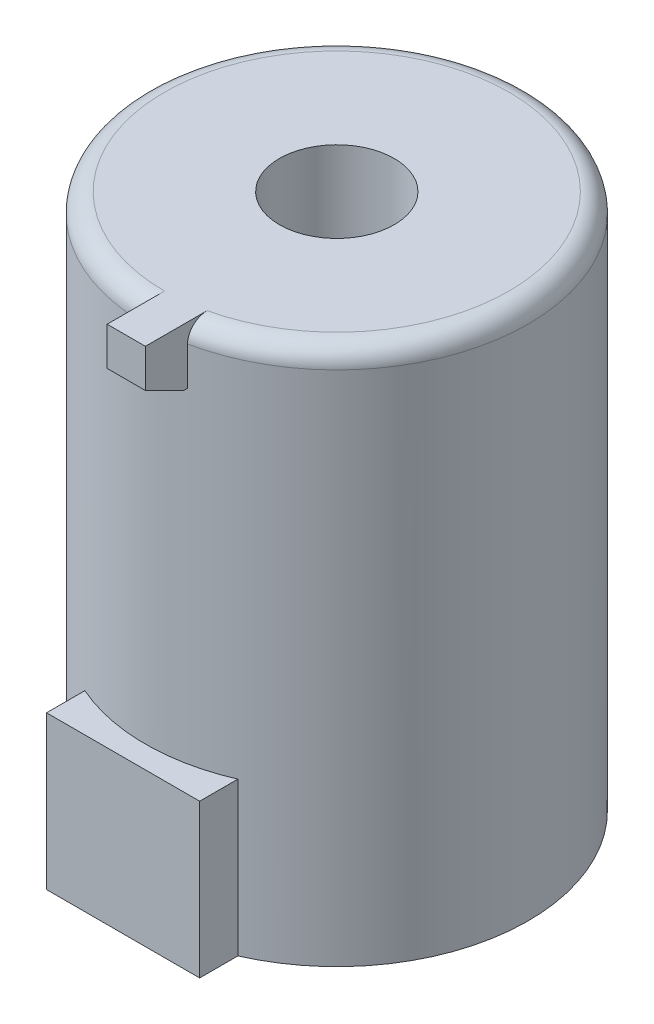
ISO-10303-21;
HEADER;
FILE_DESCRIPTION(('STEP AP214'),'2;1');
FILE_NAME('part.step','',(''),(''),'','','');
FILE_SCHEMA(('AUTOMOTIVE_DESIGN { 1 0 10303 214 1 1 1 1 }'));
ENDSEC;
DATA;
#1=APPLICATION_CONTEXT('core data for automotive mechanical design processes');
#2=APPLICATION_PROTOCOL_DEFINITION('international standard','automotive_design',2000,#1);
#3=PRODUCT_CONTEXT('',#1,'mechanical');
#4=PRODUCT('Part','Part','',(#3));
#5=PRODUCT_RELATED_PRODUCT_CATEGORY('part','',(#4));
#6=PRODUCT_DEFINITION_FORMATION('','',#4);
#7=PRODUCT_DEFINITION_CONTEXT('part definition',#1,'design');
#8=PRODUCT_DEFINITION('design','',#6,#7);
#9=PRODUCT_DEFINITION_SHAPE('','',#8);
#10=(LENGTH_UNIT() NAMED_UNIT(*) SI_UNIT(.MILLI.,.METRE.));
#11=(NAMED_UNIT(*) PLANE_ANGLE_UNIT() SI_UNIT($,.RADIAN.));
#12=(NAMED_UNIT(*) SI_UNIT($,.STERADIAN.) SOLID_ANGLE_UNIT());
#13=UNCERTAINTY_MEASURE_WITH_UNIT(LENGTH_MEASURE(1.E-05),#10,'distance_accuracy_value','');
#14=(GEOMETRIC_REPRESENTATION_CONTEXT(3) GLOBAL_UNCERTAINTY_ASSIGNED_CONTEXT((#13)) GLOBAL_UNIT_ASSIGNED_CONTEXT((#10,
#11,#12)) REPRESENTATION_CONTEXT('',''));
#15=CARTESIAN_POINT('',(0.,0.,0.));
#16=DIRECTION('',(0.,0.,1.));
#17=DIRECTION('',(1.,0.,0.));
#18=AXIS2_PLACEMENT_3D('',#15,#16,#17);
#19=CARTESIAN_POINT('',(0.,140.,0.));
#20=DIRECTION('',(0.,-1.,0.));
#21=DIRECTION('',(0.,0.,-1.));
#22=AXIS2_PLACEMENT_3D('',#19,#20,#21);
#23=CYLINDRICAL_SURFACE('',#22,50.);
#24=CARTESIAN_POINT('',(0.,40.,0.));
#25=DIRECTION('',(0.,1.,0.));
#26=DIRECTION('',(0.,0.,1.));
#27=AXIS2_PLACEMENT_3D('',#24,#25,#26);
#28=CIRCLE('',#27,50.);
#29=CARTESIAN_POINT('',(-20.,40.,45.8257569495584));
#30=VERTEX_POINT('',#29);
#31=CARTESIAN_POINT('',(20.,40.,45.8257569495584));
#32=VERTEX_POINT('',#31);
#33=EDGE_CURVE('E191',#30,#32,#28,.T.);
#34=ORIENTED_EDGE('',*,*,#33,.T.);
#35=DIRECTION('',(0.,-1.,0.));
#36=VECTOR('',#35,1.);
#37=CARTESIAN_POINT('',(20.,40.,45.8257569495584));
#38=LINE('',#37,#36);
#39=CARTESIAN_POINT('',(20.,0.,45.8257569495584));
#40=VERTEX_POINT('',#39);
#41=EDGE_CURVE('E185',#32,#40,#38,.T.);
#42=ORIENTED_EDGE('',*,*,#41,.T.);
#43=CARTESIAN_POINT('',(0.,0.,0.));
#44=DIRECTION('',(0.,1.,0.));
#45=DIRECTION('',(0.,0.,1.));
#46=AXIS2_PLACEMENT_3D('',#43,#44,#45);
#47=CIRCLE('',#46,50.);
#48=CARTESIAN_POINT('',(-20.,0.,45.8257569495584));
#49=VERTEX_POINT('',#48);
#50=EDGE_CURVE('E182',#40,#49,#47,.T.);
#51=ORIENTED_EDGE('',*,*,#50,.T.);
#52=DIRECTION('',(0.,-1.,0.));
#53=VECTOR('',#52,1.);
#54=CARTESIAN_POINT('',(-20.,40.,45.8257569495584));
#55=LINE('',#54,#53);
#56=EDGE_CURVE('E172',#30,#49,#55,.T.);
#57=ORIENTED_EDGE('',*,*,#56,.F.);
#58=EDGE_LOOP('',(#34,#42,#51,#57));
#59=FACE_BOUND('',#58,.T.);
#60=DIRECTION('',(0.,-1.,0.));
#61=VECTOR('',#60,1.);
#62=CARTESIAN_POINT('',(0.,140.,50.));
#63=LINE('',#62,#61);
#64=CARTESIAN_POINT('',(0.,125.,50.));
#65=VERTEX_POINT('',#64);
#66=CARTESIAN_POINT('',(0.,135.,50.));
#67=VERTEX_POINT('',#66);
#68=EDGE_CURVE('E131',#65,#67,#63,.F.);
#69=ORIENTED_EDGE('',*,*,#68,.T.);
#70=CARTESIAN_POINT('',(0.,135.,0.));
#71=DIRECTION('',(0.,1.,0.));
#72=DIRECTION('',(0.,0.,1.));
#73=AXIS2_PLACEMENT_3D('',#70,#71,#72);
#74=CIRCLE('',#73,50.);
#75=CARTESIAN_POINT('',(10.,135.,48.9897948556636));
#76=VERTEX_POINT('',#75);
#77=EDGE_CURVE('E60',#67,#76,#74,.F.);
#78=ORIENTED_EDGE('',*,*,#77,.T.);
#79=DIRECTION('',(0.,-1.,0.));
#80=VECTOR('',#79,1.);
#81=CARTESIAN_POINT('',(10.,140.,48.9897948556636));
#82=LINE('',#81,#80);
#83=CARTESIAN_POINT('',(10.,125.,48.9897948556636));
#84=VERTEX_POINT('',#83);
#85=EDGE_CURVE('E153',#84,#76,#82,.F.);
#86=ORIENTED_EDGE('',*,*,#85,.F.);
#87=CARTESIAN_POINT('',(0.,125.,0.));
#88=DIRECTION('',(0.,1.,0.));
#89=DIRECTION('',(0.,0.,1.));
#90=AXIS2_PLACEMENT_3D('',#87,#88,#89);
#91=CIRCLE('',#90,50.);
#92=EDGE_CURVE('E193',#65,#84,#91,.T.);
#93=ORIENTED_EDGE('',*,*,#92,.F.);
#94=EDGE_LOOP('',(#69,#78,#86,#93));
#95=FACE_BOUND('',#94,.T.);
#96=ADVANCED_FACE('F34',(#59,#95),#23,.T.);
#97=CARTESIAN_POINT('',(0.,140.,0.));
#98=DIRECTION('',(0.,1.,0.));
#99=DIRECTION('',(0.,0.,1.));
#100=AXIS2_PLACEMENT_3D('',#97,#98,#99);
#101=PLANE('',#100);
#102=CARTESIAN_POINT('',(0.,140.,0.));
#103=DIRECTION('',(0.,1.,0.));
#104=DIRECTION('',(0.,0.,1.));
#105=AXIS2_PLACEMENT_3D('',#102,#103,#104);
#106=CIRCLE('',#105,45.);
#107=CARTESIAN_POINT('',(10.,140.,43.8748219369606));
#108=VERTEX_POINT('',#107);
#109=CARTESIAN_POINT('',(0.,140.,45.));
#110=VERTEX_POINT('',#109);
#111=EDGE_CURVE('E195',#108,#110,#106,.T.);
#112=ORIENTED_EDGE('',*,*,#111,.T.);
#113=DIRECTION('',(0.,0.,1.));
#114=VECTOR('',#113,1.);
#115=CARTESIAN_POINT('',(0.,140.,50.));
#116=LINE('',#115,#114);
#117=CARTESIAN_POINT('',(0.,140.,60.));
#118=VERTEX_POINT('',#117);
#119=EDGE_CURVE('E128',#110,#118,#116,.T.);
#120=ORIENTED_EDGE('',*,*,#119,.T.);
#121=DIRECTION('',(-1.,0.,0.));
#122=VECTOR('',#121,1.);
#123=CARTESIAN_POINT('',(10.,140.,60.));
#124=LINE('',#123,#122);
#125=CARTESIAN_POINT('',(10.,140.,60.));
#126=VERTEX_POINT('',#125);
#127=EDGE_CURVE('E125',#126,#118,#124,.T.);
#128=ORIENTED_EDGE('',*,*,#127,.F.);
#129=DIRECTION('',(0.,0.,1.));
#130=VECTOR('',#129,1.);
#131=CARTESIAN_POINT('',(10.,140.,50.));
#132=LINE('',#131,#130);
#133=EDGE_CURVE('E111',#108,#126,#132,.T.);
#134=ORIENTED_EDGE('',*,*,#133,.F.);
#135=EDGE_LOOP('',(#112,#120,#128,#134));
#136=FACE_BOUND('',#135,.T.);
#137=CARTESIAN_POINT('',(0.,140.,0.));
#138=DIRECTION('',(0.,1.,0.));
#139=DIRECTION('',(0.,0.,1.));
#140=AXIS2_PLACEMENT_3D('',#137,#138,#139);
#141=CIRCLE('',#140,15.);
#142=CARTESIAN_POINT('',(0.,140.,15.));
#143=VERTEX_POINT('',#142);
#144=EDGE_CURVE('E155',#143,#143,#141,.T.);
#145=ORIENTED_EDGE('',*,*,#144,.F.);
#146=EDGE_LOOP('',(#145));
#147=FACE_BOUND('',#146,.T.);
#148=ADVANCED_FACE('F126',(#136,#147),#101,.T.);
#149=CARTESIAN_POINT('',(0.,0.,0.));
#150=DIRECTION('',(0.,1.,0.));
#151=DIRECTION('',(0.,0.,1.));
#152=AXIS2_PLACEMENT_3D('',#149,#150,#151);
#153=PLANE('',#152);
#154=ORIENTED_EDGE('',*,*,#50,.F.);
#155=DIRECTION('',(0.,0.,1.));
#156=VECTOR('',#155,1.);
#157=CARTESIAN_POINT('',(20.,0.,45.8257569495584));
#158=LINE('',#157,#156);
#159=CARTESIAN_POINT('',(20.,0.,55.8257569495584));
#160=VERTEX_POINT('',#159);
#161=EDGE_CURVE('E175',#40,#160,#158,.T.);
#162=ORIENTED_EDGE('',*,*,#161,.T.);
#163=DIRECTION('',(-1.,0.,0.));
#164=VECTOR('',#163,1.);
#165=CARTESIAN_POINT('',(-20.,0.,55.8257569495584));
#166=LINE('',#165,#164);
#167=CARTESIAN_POINT('',(-20.,0.,55.8257569495584));
#168=VERTEX_POINT('',#167);
#169=EDGE_CURVE('E166',#160,#168,#166,.T.);
#170=ORIENTED_EDGE('',*,*,#169,.T.);
#171=DIRECTION('',(0.,0.,-1.));
#172=VECTOR('',#171,1.);
#173=CARTESIAN_POINT('',(-20.,0.,45.8257569495584));
#174=LINE('',#173,#172);
#175=EDGE_CURVE('E159',#168,#49,#174,.T.);
#176=ORIENTED_EDGE('',*,*,#175,.T.);
#177=EDGE_LOOP('',(#154,#162,#170,#176));
#178=FACE_BOUND('',#177,.T.);
#179=ADVANCED_FACE('F211',(#178),#153,.F.);
#180=CARTESIAN_POINT('',(-20.,40.,45.8257569495584));
#181=DIRECTION('',(-1.,0.,0.));
#182=DIRECTION('',(0.,0.,1.));
#183=AXIS2_PLACEMENT_3D('',#180,#181,#182);
#184=PLANE('',#183);
#185=ORIENTED_EDGE('',*,*,#175,.F.);
#186=DIRECTION('',(0.,-1.,0.));
#187=VECTOR('',#186,1.);
#188=CARTESIAN_POINT('',(-20.,40.,55.8257569495584));
#189=LINE('',#188,#187);
#190=CARTESIAN_POINT('',(-20.,40.,55.8257569495584));
#191=VERTEX_POINT('',#190);
#192=EDGE_CURVE('E180',#191,#168,#189,.T.);
#193=ORIENTED_EDGE('',*,*,#192,.F.);
#194=DIRECTION('',(0.,0.,-1.));
#195=VECTOR('',#194,1.);
#196=CARTESIAN_POINT('',(-20.,40.,45.8257569495584));
#197=LINE('',#196,#195);
#198=EDGE_CURVE('E162',#191,#30,#197,.T.);
#199=ORIENTED_EDGE('',*,*,#198,.T.);
#200=ORIENTED_EDGE('',*,*,#56,.T.);
#201=EDGE_LOOP('',(#185,#193,#199,#200));
#202=FACE_BOUND('',#201,.T.);
#203=ADVANCED_FACE('F215',(#202),#184,.T.);
#204=CARTESIAN_POINT('',(-20.,40.,55.8257569495584));
#205=DIRECTION('',(0.,0.,1.));
#206=DIRECTION('',(1.,0.,0.));
#207=AXIS2_PLACEMENT_3D('',#204,#205,#206);
#208=PLANE('',#207);
#209=ORIENTED_EDGE('',*,*,#169,.F.);
#210=DIRECTION('',(0.,-1.,0.));
#211=VECTOR('',#210,1.);
#212=CARTESIAN_POINT('',(20.,40.,55.8257569495584));
#213=LINE('',#212,#211);
#214=CARTESIAN_POINT('',(20.,40.,55.8257569495584));
#215=VERTEX_POINT('',#214);
#216=EDGE_CURVE('E183',#215,#160,#213,.T.);
#217=ORIENTED_EDGE('',*,*,#216,.F.);
#218=DIRECTION('',(-1.,0.,0.));
#219=VECTOR('',#218,1.);
#220=CARTESIAN_POINT('',(-20.,40.,55.8257569495584));
#221=LINE('',#220,#219);
#222=EDGE_CURVE('E169',#215,#191,#221,.T.);
#223=ORIENTED_EDGE('',*,*,#222,.T.);
#224=ORIENTED_EDGE('',*,*,#192,.T.);
#225=EDGE_LOOP('',(#209,#217,#223,#224));
#226=FACE_BOUND('',#225,.T.);
#227=ADVANCED_FACE('F220',(#226),#208,.T.);
#228=CARTESIAN_POINT('',(20.,40.,45.8257569495584));
#229=DIRECTION('',(1.,0.,0.));
#230=DIRECTION('',(0.,0.,-1.));
#231=AXIS2_PLACEMENT_3D('',#228,#229,#230);
#232=PLANE('',#231);
#233=ORIENTED_EDGE('',*,*,#161,.F.);
#234=ORIENTED_EDGE('',*,*,#41,.F.);
#235=DIRECTION('',(0.,0.,1.));
#236=VECTOR('',#235,1.);
#237=CARTESIAN_POINT('',(20.,40.,45.8257569495584));
#238=LINE('',#237,#236);
#239=EDGE_CURVE('E165',#32,#215,#238,.T.);
#240=ORIENTED_EDGE('',*,*,#239,.T.);
#241=ORIENTED_EDGE('',*,*,#216,.T.);
#242=EDGE_LOOP('',(#233,#234,#240,#241));
#243=FACE_BOUND('',#242,.T.);
#244=ADVANCED_FACE('F222',(#243),#232,.T.);
#245=CARTESIAN_POINT('',(0.,40.,0.));
#246=DIRECTION('',(0.,1.,0.));
#247=DIRECTION('',(0.,0.,1.));
#248=AXIS2_PLACEMENT_3D('',#245,#246,#247);
#249=PLANE('',#248);
#250=ORIENTED_EDGE('',*,*,#33,.F.);
#251=ORIENTED_EDGE('',*,*,#198,.F.);
#252=ORIENTED_EDGE('',*,*,#222,.F.);
#253=ORIENTED_EDGE('',*,*,#239,.F.);
#254=EDGE_LOOP('',(#250,#251,#252,#253));
#255=FACE_BOUND('',#254,.T.);
#256=ADVANCED_FACE('F225',(#255),#249,.T.);
#257=CARTESIAN_POINT('',(0.,100.,0.));
#258=DIRECTION('',(0.,1.,0.));
#259=DIRECTION('',(0.,0.,1.));
#260=AXIS2_PLACEMENT_3D('',#257,#258,#259);
#261=CYLINDRICAL_SURFACE('',#260,15.);
#262=CARTESIAN_POINT('',(0.,100.,0.));
#263=DIRECTION('',(0.,1.,0.));
#264=DIRECTION('',(0.,0.,1.));
#265=AXIS2_PLACEMENT_3D('',#262,#263,#264);
#266=CIRCLE('',#265,15.);
#267=CARTESIAN_POINT('',(0.,100.,15.));
#268=VERTEX_POINT('',#267);
#269=EDGE_CURVE('E156',#268,#268,#266,.T.);
#270=ORIENTED_EDGE('',*,*,#269,.F.);
#271=EDGE_LOOP('',(#270));
#272=FACE_BOUND('',#271,.T.);
#273=ORIENTED_EDGE('',*,*,#144,.T.);
#274=EDGE_LOOP('',(#273));
#275=FACE_BOUND('',#274,.T.);
#276=ADVANCED_FACE('F232',(#272,#275),#261,.F.);
#277=CARTESIAN_POINT('',(0.,100.,0.));
#278=DIRECTION('',(0.,1.,0.));
#279=DIRECTION('',(0.,0.,1.));
#280=AXIS2_PLACEMENT_3D('',#277,#278,#279);
#281=PLANE('',#280);
#282=ORIENTED_EDGE('',*,*,#269,.T.);
#283=EDGE_LOOP('',(#282));
#284=FACE_BOUND('',#283,.T.);
#285=ADVANCED_FACE('F236',(#284),#281,.T.);
#286=CARTESIAN_POINT('',(10.,0.,0.));
#287=DIRECTION('',(-1.,0.,0.));
#288=DIRECTION('',(0.,0.,1.));
#289=AXIS2_PLACEMENT_3D('',#286,#287,#288);
#290=PLANE('',#289);
#291=DIRECTION('',(0.,0.,-1.));
#292=VECTOR('',#291,1.);
#293=CARTESIAN_POINT('',(10.,125.,44.5875534039273));
#294=LINE('',#293,#292);
#295=CARTESIAN_POINT('',(10.,125.,50.));
#296=VERTEX_POINT('',#295);
#297=EDGE_CURVE('E139',#296,#84,#294,.T.);
#298=ORIENTED_EDGE('',*,*,#297,.T.);
#299=ORIENTED_EDGE('',*,*,#85,.T.);
#300=CARTESIAN_POINT('',(10.,135.,48.9897948556636));
#301=CARTESIAN_POINT('',(10.,135.138506627266,48.9898115538362));
#302=CARTESIAN_POINT('',(10.,135.277010148974,48.9839216720948));
#303=CARTESIAN_POINT('',(10.,135.553011598371,48.960449901164));
#304=CARTESIAN_POINT('',(10.,135.690509610314,48.942869003211));
#305=CARTESIAN_POINT('',(10.,135.963349241789,48.896166309564));
#306=CARTESIAN_POINT('',(10.,136.098693402898,48.8670593578651));
#307=CARTESIAN_POINT('',(10.,136.366444491823,48.7975391729353));
#308=CARTESIAN_POINT('',(10.,136.498851435119,48.7571259993039));
#309=CARTESIAN_POINT('',(10.,136.759810968154,48.665303195703));
#310=CARTESIAN_POINT('',(10.,136.888363138512,48.6138923741562));
#311=CARTESIAN_POINT('',(10.,137.140750808382,48.500454774228));
#312=CARTESIAN_POINT('',(10.,137.264584548815,48.4384240830899));
#313=CARTESIAN_POINT('',(10.,137.506586017978,48.3042629261796));
#314=CARTESIAN_POINT('',(10.,137.62475606601,48.2321366428566));
#315=CARTESIAN_POINT('',(10.,137.854731744212,48.0782813085418));
#316=CARTESIAN_POINT('',(10.,137.966534989821,47.9965486943482));
#317=CARTESIAN_POINT('',(10.,138.183839844166,47.8234339460534));
#318=CARTESIAN_POINT('',(10.,138.289285209177,47.7319812179145));
#319=CARTESIAN_POINT('',(10.,138.492257985803,47.5406057631321));
#320=CARTESIAN_POINT('',(10.,138.589782457754,47.4406799197466));
#321=CARTESIAN_POINT('',(10.,138.776228857803,47.2331349672292));
#322=CARTESIAN_POINT('',(10.,138.86515228476,47.1255172042323));
#323=CARTESIAN_POINT('',(10.,139.033890744878,46.9033047228695));
#324=CARTESIAN_POINT('',(10.,139.113702462062,46.788707487621));
#325=CARTESIAN_POINT('',(10.,139.265127194129,46.5511296151638));
#326=CARTESIAN_POINT('',(10.,139.336554776536,46.4280307605955));
#327=CARTESIAN_POINT('',(10.,139.468997207748,46.1762928251856));
#328=CARTESIAN_POINT('',(10.,139.530007731808,46.0476514709418));
#329=CARTESIAN_POINT('',(10.,139.641188498038,45.7858441578451));
#330=CARTESIAN_POINT('',(10.,139.691364635604,45.6526807055201));
#331=CARTESIAN_POINT('',(10.,139.780636573152,45.3826892693758));
#332=CARTESIAN_POINT('',(10.,139.819730271106,45.2458605957463));
#333=CARTESIAN_POINT('',(10.,139.901976576795,44.9059029349262));
#334=CARTESIAN_POINT('',(10.,139.938751571935,44.7011774175498));
#335=CARTESIAN_POINT('',(10.,139.975506605034,44.3921926470395));
#336=CARTESIAN_POINT('',(10.,139.984690373803,44.2889324375789));
#337=CARTESIAN_POINT('',(10.,139.996935611182,44.082065550097));
#338=CARTESIAN_POINT('',(10.,139.999998028799,43.978458928276));
#339=CARTESIAN_POINT('',(10.,140.,43.8748219369606));
#340=B_SPLINE_CURVE_WITH_KNOTS('',3,(#300,#301,#302,#303,#304,#305,#306,#307,#308,#309,#310,
#311,#312,#313,#314,#315,#316,#317,#318,#319,#320,#321,#322,#323,#324,#325,#326,#327,#328,#329,
#330,#331,#332,#333,#334,#335,#336,#337,#338,#339),.UNSPECIFIED.,.F.,.F.,(4,2,2,2,2,2,2,2,2,2,2,
2,2,2,2,2,2,2,2,4),(0.,0.415390151035162,0.830745087221081,1.24556683322783,1.66038639258296,
2.07525091974584,2.49026862874127,2.90511490836302,3.32011555221394,3.7383680924566,
4.15677515529161,4.57510917267085,4.99359495000745,5.42006342864547,5.84670853166288,
6.27312089279462,6.69961407833225,7.32192595154536,7.63277897931185,7.94358381113207),.UNSPECIFIED.);
#341=EDGE_CURVE('E11',#76,#108,#340,.T.);
#342=ORIENTED_EDGE('',*,*,#341,.T.);
#343=ORIENTED_EDGE('',*,*,#133,.T.);
#344=DIRECTION('',(0.,-1.,0.));
#345=VECTOR('',#344,1.);
#346=CARTESIAN_POINT('',(10.,140.,60.));
#347=LINE('',#346,#345);
#348=CARTESIAN_POINT('',(10.,130.,60.));
#349=VERTEX_POINT('',#348);
#350=EDGE_CURVE('E116',#126,#349,#347,.T.);
#351=ORIENTED_EDGE('',*,*,#350,.T.);
#352=DIRECTION('',(0.,-0.447213595499958,-0.894427190999916));
#353=VECTOR('',#352,1.);
#354=CARTESIAN_POINT('',(10.,130.,60.));
#355=LINE('',#354,#353);
#356=EDGE_CURVE('E137',#349,#296,#355,.T.);
#357=ORIENTED_EDGE('',*,*,#356,.T.);
#358=EDGE_LOOP('',(#298,#299,#342,#343,#351,#357));
#359=FACE_BOUND('',#358,.T.);
#360=ADVANCED_FACE('F114',(#359),#290,.F.);
#361=CARTESIAN_POINT('',(0.,0.,0.));
#362=DIRECTION('',(-1.,0.,0.));
#363=DIRECTION('',(0.,0.,1.));
#364=AXIS2_PLACEMENT_3D('',#361,#362,#363);
#365=PLANE('',#364);
#366=ORIENTED_EDGE('',*,*,#68,.F.);
#367=DIRECTION('',(0.,-0.447213595499958,-0.894427190999916));
#368=VECTOR('',#367,1.);
#369=CARTESIAN_POINT('',(0.,130.,60.));
#370=LINE('',#369,#368);
#371=CARTESIAN_POINT('',(0.,130.,60.));
#372=VERTEX_POINT('',#371);
#373=EDGE_CURVE('E122',#372,#65,#370,.T.);
#374=ORIENTED_EDGE('',*,*,#373,.F.);
#375=DIRECTION('',(0.,-1.,0.));
#376=VECTOR('',#375,1.);
#377=CARTESIAN_POINT('',(0.,140.,60.));
#378=LINE('',#377,#376);
#379=EDGE_CURVE('E145',#118,#372,#378,.T.);
#380=ORIENTED_EDGE('',*,*,#379,.F.);
#381=ORIENTED_EDGE('',*,*,#119,.F.);
#382=CARTESIAN_POINT('',(0.,135.,45.));
#383=DIRECTION('',(-1.,0.,0.));
#384=DIRECTION('',(0.,0.,1.));
#385=AXIS2_PLACEMENT_3D('',#382,#383,#384);
#386=CIRCLE('',#385,5.);
#387=EDGE_CURVE('E47',#110,#67,#386,.F.);
#388=ORIENTED_EDGE('',*,*,#387,.T.);
#389=EDGE_LOOP('',(#366,#374,#380,#381,#388));
#390=FACE_BOUND('',#389,.T.);
#391=ADVANCED_FACE('F243',(#390),#365,.T.);
#392=CARTESIAN_POINT('',(10.,140.,60.));
#393=DIRECTION('',(0.,0.,-1.));
#394=DIRECTION('',(-1.,0.,0.));
#395=AXIS2_PLACEMENT_3D('',#392,#393,#394);
#396=PLANE('',#395);
#397=ORIENTED_EDGE('',*,*,#379,.T.);
#398=DIRECTION('',(-1.,0.,0.));
#399=VECTOR('',#398,1.);
#400=CARTESIAN_POINT('',(10.,130.,60.));
#401=LINE('',#400,#399);
#402=EDGE_CURVE('E132',#349,#372,#401,.T.);
#403=ORIENTED_EDGE('',*,*,#402,.F.);
#404=ORIENTED_EDGE('',*,*,#350,.F.);
#405=ORIENTED_EDGE('',*,*,#127,.T.);
#406=EDGE_LOOP('',(#397,#403,#404,#405));
#407=FACE_BOUND('',#406,.T.);
#408=ADVANCED_FACE('F134',(#407),#396,.F.);
#409=CARTESIAN_POINT('',(10.,130.,60.));
#410=DIRECTION('',(0.,0.894427190999916,-0.447213595499958));
#411=DIRECTION('',(0.,0.447213595499958,0.894427190999916));
#412=AXIS2_PLACEMENT_3D('',#409,#410,#411);
#413=PLANE('',#412);
#414=ORIENTED_EDGE('',*,*,#373,.T.);
#415=DIRECTION('',(-1.,0.,0.));
#416=VECTOR('',#415,1.);
#417=CARTESIAN_POINT('',(10.,125.,50.));
#418=LINE('',#417,#416);
#419=EDGE_CURVE('E143',#296,#65,#418,.T.);
#420=ORIENTED_EDGE('',*,*,#419,.F.);
#421=ORIENTED_EDGE('',*,*,#356,.F.);
#422=ORIENTED_EDGE('',*,*,#402,.T.);
#423=EDGE_LOOP('',(#414,#420,#421,#422));
#424=FACE_BOUND('',#423,.T.);
#425=ADVANCED_FACE('F203',(#424),#413,.F.);
#426=CARTESIAN_POINT('',(10.,125.,44.5875534039273));
#427=DIRECTION('',(0.,1.,0.));
#428=DIRECTION('',(0.,0.,1.));
#429=AXIS2_PLACEMENT_3D('',#426,#427,#428);
#430=PLANE('',#429);
#431=ORIENTED_EDGE('',*,*,#419,.T.);
#432=ORIENTED_EDGE('',*,*,#92,.T.);
#433=ORIENTED_EDGE('',*,*,#297,.F.);
#434=EDGE_LOOP('',(#431,#432,#433));
#435=FACE_BOUND('',#434,.T.);
#436=ADVANCED_FACE('F199',(#435),#430,.F.);
#437=CARTESIAN_POINT('',(0.,135.,0.));
#438=DIRECTION('',(0.,1.,0.));
#439=DIRECTION('',(0.,0.,1.));
#440=AXIS2_PLACEMENT_3D('',#437,#438,#439);
#441=TOROIDAL_SURFACE('',#440,45.,5.);
#442=ORIENTED_EDGE('',*,*,#341,.F.);
#443=ORIENTED_EDGE('',*,*,#77,.F.);
#444=ORIENTED_EDGE('',*,*,#387,.F.);
#445=ORIENTED_EDGE('',*,*,#111,.F.);
#446=EDGE_LOOP('',(#442,#443,#444,#445));
#447=FACE_BOUND('',#446,.T.);
#448=ADVANCED_FACE('F36',(#447),#441,.T.);
#449=CLOSED_SHELL('',(#96,#148,#179,#203,#227,#244,#256,#276,#285,#360,#391,#408,#425,#436,#448));
#450=MANIFOLD_SOLID_BREP('B2',#449);
#451=ADVANCED_BREP_SHAPE_REPRESENTATION('',(#18,#450),#14);
#452=SHAPE_DEFINITION_REPRESENTATION(#9,#451);
ENDSEC;
END-ISO-10303-21;
